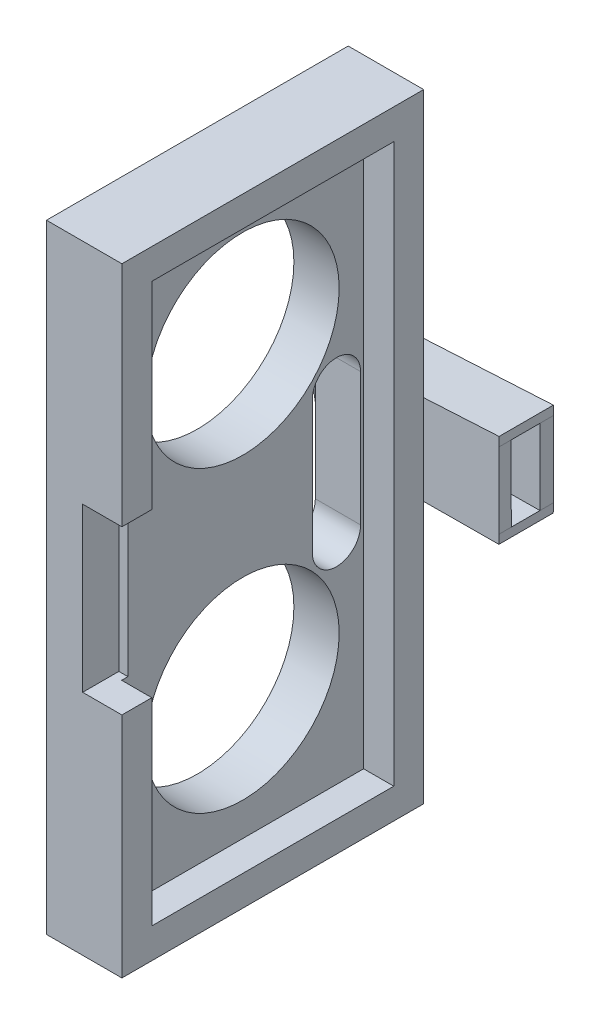
ISO-10303-21;
HEADER;
FILE_DESCRIPTION(('STEP AP214'),'2;1');
FILE_NAME('part.step','',(''),(''),'','','');
FILE_SCHEMA(('AUTOMOTIVE_DESIGN { 1 0 10303 214 1 1 1 1 }'));
ENDSEC;
DATA;
#1=APPLICATION_CONTEXT('core data for automotive mechanical design processes');
#2=APPLICATION_PROTOCOL_DEFINITION('international standard','automotive_design',2000,#1);
#3=PRODUCT_CONTEXT('',#1,'mechanical');
#4=PRODUCT('Part','Part','',(#3));
#5=PRODUCT_RELATED_PRODUCT_CATEGORY('part','',(#4));
#6=PRODUCT_DEFINITION_FORMATION('','',#4);
#7=PRODUCT_DEFINITION_CONTEXT('part definition',#1,'design');
#8=PRODUCT_DEFINITION('design','',#6,#7);
#9=PRODUCT_DEFINITION_SHAPE('','',#8);
#10=(LENGTH_UNIT() NAMED_UNIT(*) SI_UNIT(.MILLI.,.METRE.));
#11=(NAMED_UNIT(*) PLANE_ANGLE_UNIT() SI_UNIT($,.RADIAN.));
#12=(NAMED_UNIT(*) SI_UNIT($,.STERADIAN.) SOLID_ANGLE_UNIT());
#13=UNCERTAINTY_MEASURE_WITH_UNIT(LENGTH_MEASURE(1.E-05),#10,'distance_accuracy_value','');
#14=(GEOMETRIC_REPRESENTATION_CONTEXT(3) GLOBAL_UNCERTAINTY_ASSIGNED_CONTEXT((#13)) GLOBAL_UNIT_ASSIGNED_CONTEXT((#10,
#11,#12)) REPRESENTATION_CONTEXT('',''));
#15=CARTESIAN_POINT('',(0.,0.,0.));
#16=DIRECTION('',(0.,0.,1.));
#17=DIRECTION('',(1.,0.,0.));
#18=AXIS2_PLACEMENT_3D('',#15,#16,#17);
#19=CARTESIAN_POINT('',(-11.1100924159061,-23.495,24.4094));
#20=DIRECTION('',(0.,0.,1.));
#21=DIRECTION('',(1.,0.,0.));
#22=AXIS2_PLACEMENT_3D('',#19,#20,#21);
#23=PLANE('',#22);
#24=DIRECTION('',(0.,-1.,0.));
#25=VECTOR('',#24,1.);
#26=CARTESIAN_POINT('',(-8.57009241590608,-23.495,24.4094));
#27=LINE('',#26,#25);
#28=CARTESIAN_POINT('',(-8.57009241590608,23.495,24.4094));
#29=VERTEX_POINT('',#28);
#30=CARTESIAN_POINT('',(-8.57009241590608,6.858,24.4094));
#31=VERTEX_POINT('',#30);
#32=EDGE_CURVE('E331',#29,#31,#27,.T.);
#33=ORIENTED_EDGE('',*,*,#32,.T.);
#34=DIRECTION('',(-1.,0.,0.));
#35=VECTOR('',#34,1.);
#36=CARTESIAN_POINT('',(-11.1100924159061,6.858,24.4094));
#37=LINE('',#36,#35);
#38=CARTESIAN_POINT('',(-11.1100924159061,6.858,24.4094));
#39=VERTEX_POINT('',#38);
#40=EDGE_CURVE('E301',#31,#39,#37,.T.);
#41=ORIENTED_EDGE('',*,*,#40,.T.);
#42=DIRECTION('',(0.,-1.,0.));
#43=VECTOR('',#42,1.);
#44=CARTESIAN_POINT('',(-11.1100924159061,-23.495,24.4094));
#45=LINE('',#44,#43);
#46=CARTESIAN_POINT('',(-11.1100924159061,23.495,24.4094));
#47=VERTEX_POINT('',#46);
#48=EDGE_CURVE('E317',#47,#39,#45,.T.);
#49=ORIENTED_EDGE('',*,*,#48,.F.);
#50=DIRECTION('',(1.,0.,0.));
#51=VECTOR('',#50,1.);
#52=CARTESIAN_POINT('',(-11.1100924159061,23.495,24.4094));
#53=LINE('',#52,#51);
#54=EDGE_CURVE('E343',#47,#29,#53,.T.);
#55=ORIENTED_EDGE('',*,*,#54,.T.);
#56=EDGE_LOOP('',(#33,#41,#49,#55));
#57=FACE_BOUND('',#56,.T.);
#58=ADVANCED_FACE('F41',(#57),#23,.F.);
#59=CARTESIAN_POINT('',(0.,0.,1.524));
#60=DIRECTION('',(0.,0.,1.));
#61=DIRECTION('',(1.,0.,0.));
#62=AXIS2_PLACEMENT_3D('',#59,#60,#61);
#63=PLANE('',#62);
#64=DIRECTION('',(0.,-1.,0.));
#65=VECTOR('',#64,1.);
#66=CARTESIAN_POINT('',(-14.9200924159061,26.035,1.524));
#67=LINE('',#66,#65);
#68=CARTESIAN_POINT('',(-14.9200924159061,3.18748476865478,1.524));
#69=VERTEX_POINT('',#68);
#70=CARTESIAN_POINT('',(-14.9200924159061,-3.94417336261971,1.524));
#71=VERTEX_POINT('',#70);
#72=EDGE_CURVE('E369',#69,#71,#67,.T.);
#73=ORIENTED_EDGE('',*,*,#72,.F.);
#74=CARTESIAN_POINT('',(-14.1591219670421,-0.378344296982466,1.524));
#75=DIRECTION('',(0.,0.,1.));
#76=DIRECTION('',(1.,0.,0.));
#77=AXIS2_PLACEMENT_3D('',#74,#75,#76);
#78=CIRCLE('',#77,3.64612300250384);
#79=EDGE_CURVE('E428',#69,#71,#78,.T.);
#80=ORIENTED_EDGE('',*,*,#79,.T.);
#81=EDGE_LOOP('',(#73,#80));
#82=FACE_BOUND('',#81,.T.);
#83=ADVANCED_FACE('F532',(#82),#63,.T.);
#84=CARTESIAN_POINT('',(-0.178664404636006,3.26970413285016,-3.048));
#85=DIRECTION('',(0.0545609835210733,-0.998510440144325,0.));
#86=DIRECTION('',(0.998510440144325,0.0545609835210733,0.));
#87=AXIS2_PLACEMENT_3D('',#84,#85,#86);
#88=PLANE('',#87);
#89=DIRECTION('',(0.,0.,1.));
#90=VECTOR('',#89,1.);
#91=CARTESIAN_POINT('',(-14.1591219670421,2.50577870552137,-3.048));
#92=LINE('',#91,#90);
#93=CARTESIAN_POINT('',(-14.1591219670421,2.50577870552137,-1.905));
#94=VERTEX_POINT('',#93);
#95=CARTESIAN_POINT('',(-14.1591219670421,2.50577870552137,0.508));
#96=VERTEX_POINT('',#95);
#97=EDGE_CURVE('E458',#94,#96,#92,.T.);
#98=ORIENTED_EDGE('',*,*,#97,.F.);
#99=DIRECTION('',(0.998510440144325,0.0545609835210732,0.));
#100=VECTOR('',#99,1.);
#101=CARTESIAN_POINT('',(-14.1591219670421,2.50577870552137,-1.905));
#102=LINE('',#101,#100);
#103=CARTESIAN_POINT('',(-2.22112196704214,3.15809939751176,-1.905));
#104=VERTEX_POINT('',#103);
#105=EDGE_CURVE('E391',#94,#104,#102,.T.);
#106=ORIENTED_EDGE('',*,*,#105,.T.);
#107=DIRECTION('',(0.,0.,1.));
#108=VECTOR('',#107,1.);
#109=CARTESIAN_POINT('',(-2.22112196704214,3.15809939751176,-3.048));
#110=LINE('',#109,#108);
#111=CARTESIAN_POINT('',(-2.22112196704214,3.15809939751176,0.508));
#112=VERTEX_POINT('',#111);
#113=EDGE_CURVE('E457',#104,#112,#110,.T.);
#114=ORIENTED_EDGE('',*,*,#113,.T.);
#115=DIRECTION('',(-0.998510440144325,-0.0545609835210736,0.));
#116=VECTOR('',#115,1.);
#117=CARTESIAN_POINT('',(-14.1591219670421,2.50577870552137,0.508));
#118=LINE('',#117,#116);
#119=EDGE_CURVE('E407',#112,#96,#118,.T.);
#120=ORIENTED_EDGE('',*,*,#119,.T.);
#121=EDGE_LOOP('',(#98,#106,#114,#120));
#122=FACE_BOUND('',#121,.T.);
#123=ADVANCED_FACE('F537',(#122),#88,.T.);
#124=CARTESIAN_POINT('',(-14.1591219670421,-0.378344296982466,-3.048));
#125=DIRECTION('',(0.,0.,1.));
#126=DIRECTION('',(1.,0.,0.));
#127=AXIS2_PLACEMENT_3D('',#124,#125,#126);
#128=CYLINDRICAL_SURFACE('',#127,2.88412300250383);
#129=CARTESIAN_POINT('',(-14.1591219670421,-0.378344296982466,-1.905));
#130=DIRECTION('',(0.,0.,-1.));
#131=DIRECTION('',(-1.,0.,0.));
#132=AXIS2_PLACEMENT_3D('',#129,#130,#131);
#133=CIRCLE('',#132,2.88412300250383);
#134=CARTESIAN_POINT('',(-14.1470722034374,-3.26244212763398,-1.905));
#135=VERTEX_POINT('',#134);
#136=EDGE_CURVE('E389',#135,#94,#133,.T.);
#137=ORIENTED_EDGE('',*,*,#136,.T.);
#138=ORIENTED_EDGE('',*,*,#97,.T.);
#139=CARTESIAN_POINT('',(-14.1591219670421,-0.378344296982466,0.508));
#140=DIRECTION('',(0.,0.,1.));
#141=DIRECTION('',(1.,0.,0.));
#142=AXIS2_PLACEMENT_3D('',#139,#140,#141);
#143=CIRCLE('',#142,2.88412300250383);
#144=CARTESIAN_POINT('',(-14.1470722034374,-3.26244212763398,0.508));
#145=VERTEX_POINT('',#144);
#146=EDGE_CURVE('E410',#96,#145,#143,.T.);
#147=ORIENTED_EDGE('',*,*,#146,.T.);
#148=DIRECTION('',(0.,0.,1.));
#149=VECTOR('',#148,1.);
#150=CARTESIAN_POINT('',(-14.1470722034374,-3.26244212763398,-3.048));
#151=LINE('',#150,#149);
#152=EDGE_CURVE('E460',#135,#145,#151,.T.);
#153=ORIENTED_EDGE('',*,*,#152,.F.);
#154=EDGE_LOOP('',(#137,#138,#147,#153));
#155=FACE_BOUND('',#154,.T.);
#156=ADVANCED_FACE('F596',(#155),#128,.F.);
#157=CARTESIAN_POINT('',(0.0187831212515852,-3.17873622718185,-3.048));
#158=DIRECTION('',(0.00590888705463329,-0.999982542374504,0.));
#159=DIRECTION('',(0.999982542374504,0.00590888705463329,0.));
#160=AXIS2_PLACEMENT_3D('',#157,#158,#159);
#161=PLANE('',#160);
#162=DIRECTION('',(-0.999982542374503,-0.00590888705463329,0.));
#163=VECTOR('',#162,1.);
#164=CARTESIAN_POINT('',(-14.1470722034374,-3.26244212763398,-1.905));
#165=LINE('',#164,#163);
#166=CARTESIAN_POINT('',(-2.20907220343745,-3.19190060248824,-1.905));
#167=VERTEX_POINT('',#166);
#168=EDGE_CURVE('E396',#167,#135,#165,.T.);
#169=ORIENTED_EDGE('',*,*,#168,.T.);
#170=ORIENTED_EDGE('',*,*,#152,.T.);
#171=DIRECTION('',(0.999982542374503,0.00590888705463329,0.));
#172=VECTOR('',#171,1.);
#173=CARTESIAN_POINT('',(-2.20907220343745,-3.19190060248824,0.508));
#174=LINE('',#173,#172);
#175=CARTESIAN_POINT('',(-2.20907220343745,-3.19190060248824,0.508));
#176=VERTEX_POINT('',#175);
#177=EDGE_CURVE('E401',#145,#176,#174,.T.);
#178=ORIENTED_EDGE('',*,*,#177,.T.);
#179=DIRECTION('',(0.,0.,1.));
#180=VECTOR('',#179,1.);
#181=CARTESIAN_POINT('',(-2.20907220343745,-3.19190060248824,-3.048));
#182=LINE('',#181,#180);
#183=EDGE_CURVE('E465',#167,#176,#182,.T.);
#184=ORIENTED_EDGE('',*,*,#183,.F.);
#185=EDGE_LOOP('',(#169,#170,#178,#184));
#186=FACE_BOUND('',#185,.T.);
#187=ADVANCED_FACE('F600',(#186),#161,.F.);
#188=CARTESIAN_POINT('',(-0.220177944928801,4.02943573434699,-3.048));
#189=DIRECTION('',(-0.0545609835210734,0.998510440144325,0.));
#190=DIRECTION('',(-0.998510440144325,-0.0545609835210734,0.));
#191=AXIS2_PLACEMENT_3D('',#188,#189,#190);
#192=PLANE('',#191);
#193=DIRECTION('',(0.,0.,1.));
#194=VECTOR('',#193,1.);
#195=CARTESIAN_POINT('',(-14.1591219670421,3.26777870552137,-3.048));
#196=LINE('',#195,#194);
#197=CARTESIAN_POINT('',(-14.1591219670421,3.26777870552137,-3.048));
#198=VERTEX_POINT('',#197);
#199=CARTESIAN_POINT('',(-14.1591219670421,3.26777870552137,1.524));
#200=VERTEX_POINT('',#199);
#201=EDGE_CURVE('E451',#198,#200,#196,.T.);
#202=ORIENTED_EDGE('',*,*,#201,.T.);
#203=DIRECTION('',(-0.998510440144325,-0.0545609835210734,0.));
#204=VECTOR('',#203,1.);
#205=CARTESIAN_POINT('',(-0.220177944928801,4.02943573434699,1.524));
#206=LINE('',#205,#204);
#207=CARTESIAN_POINT('',(-8.57009241590608,3.57317656314843,1.524));
#208=VERTEX_POINT('',#207);
#209=EDGE_CURVE('E418',#208,#200,#206,.T.);
#210=ORIENTED_EDGE('',*,*,#209,.F.);
#211=CARTESIAN_POINT('',(-2.22112196704214,3.92009939751176,1.524));
#212=VERTEX_POINT('',#211);
#213=EDGE_CURVE('E421',#212,#208,#206,.T.);
#214=ORIENTED_EDGE('',*,*,#213,.F.);
#215=DIRECTION('',(0.,0.,1.));
#216=VECTOR('',#215,1.);
#217=CARTESIAN_POINT('',(-2.22112196704214,3.92009939751176,-3.048));
#218=LINE('',#217,#216);
#219=CARTESIAN_POINT('',(-2.22112196704214,3.92009939751176,-3.048));
#220=VERTEX_POINT('',#219);
#221=EDGE_CURVE('E452',#220,#212,#218,.T.);
#222=ORIENTED_EDGE('',*,*,#221,.F.);
#223=DIRECTION('',(-0.998510440144325,-0.0545609835210734,0.));
#224=VECTOR('',#223,1.);
#225=CARTESIAN_POINT('',(-0.220177944928801,4.02943573434699,-3.048));
#226=LINE('',#225,#224);
#227=EDGE_CURVE('E438',#220,#198,#226,.T.);
#228=ORIENTED_EDGE('',*,*,#227,.T.);
#229=EDGE_LOOP('',(#202,#210,#214,#222,#228));
#230=FACE_BOUND('',#229,.T.);
#231=ADVANCED_FACE('F43',(#230),#192,.T.);
#232=CARTESIAN_POINT('',(-2.22112196704214,0.,-3.048));
#233=DIRECTION('',(1.,0.,0.));
#234=DIRECTION('',(0.,0.,-1.));
#235=AXIS2_PLACEMENT_3D('',#232,#233,#234);
#236=PLANE('',#235);
#237=ORIENTED_EDGE('',*,*,#221,.T.);
#238=DIRECTION('',(0.,1.,0.));
#239=VECTOR('',#238,1.);
#240=CARTESIAN_POINT('',(-2.22112196704214,0.,1.524));
#241=LINE('',#240,#239);
#242=CARTESIAN_POINT('',(-2.22112196704214,3.15809939751176,1.524));
#243=VERTEX_POINT('',#242);
#244=EDGE_CURVE('E435',#243,#212,#241,.T.);
#245=ORIENTED_EDGE('',*,*,#244,.F.);
#246=DIRECTION('',(0.,0.,1.));
#247=VECTOR('',#246,1.);
#248=CARTESIAN_POINT('',(-2.22112196704214,3.15809939751176,0.508));
#249=LINE('',#248,#247);
#250=EDGE_CURVE('E415',#112,#243,#249,.T.);
#251=ORIENTED_EDGE('',*,*,#250,.F.);
#252=ORIENTED_EDGE('',*,*,#113,.F.);
#253=CARTESIAN_POINT('',(-2.22112196704214,3.15809939751176,-3.048));
#254=VERTEX_POINT('',#253);
#255=EDGE_CURVE('E454',#254,#104,#110,.T.);
#256=ORIENTED_EDGE('',*,*,#255,.F.);
#257=DIRECTION('',(0.,1.,0.));
#258=VECTOR('',#257,1.);
#259=CARTESIAN_POINT('',(-2.22112196704214,0.,-3.048));
#260=LINE('',#259,#258);
#261=EDGE_CURVE('E448',#254,#220,#260,.T.);
#262=ORIENTED_EDGE('',*,*,#261,.T.);
#263=EDGE_LOOP('',(#237,#245,#251,#252,#256,#262));
#264=FACE_BOUND('',#263,.T.);
#265=ADVANCED_FACE('F589',(#264),#236,.T.);
#266=CARTESIAN_POINT('',(-2.09947621810218,0.0705284801545725,-3.048));
#267=DIRECTION('',(0.999436219896617,-0.0335744301330823,0.));
#268=DIRECTION('',(0.0335744301330823,0.999436219896617,0.));
#269=AXIS2_PLACEMENT_3D('',#266,#267,#268);
#270=PLANE('',#269);
#271=CARTESIAN_POINT('',(-2.20907220343745,-3.19190060248824,-3.048));
#272=VERTEX_POINT('',#271);
#273=EDGE_CURVE('E462',#272,#167,#182,.T.);
#274=ORIENTED_EDGE('',*,*,#273,.T.);
#275=ORIENTED_EDGE('',*,*,#183,.T.);
#276=DIRECTION('',(0.,0.,1.));
#277=VECTOR('',#276,1.);
#278=CARTESIAN_POINT('',(-2.20907220343745,-3.19190060248824,0.508));
#279=LINE('',#278,#277);
#280=CARTESIAN_POINT('',(-2.20907220343745,-3.19190060248824,1.524));
#281=VERTEX_POINT('',#280);
#282=EDGE_CURVE('E413',#176,#281,#279,.T.);
#283=ORIENTED_EDGE('',*,*,#282,.T.);
#284=DIRECTION('',(0.0335744301330823,0.999436219896617,0.));
#285=VECTOR('',#284,1.);
#286=CARTESIAN_POINT('',(-2.09947621810218,0.0705284801545725,1.524));
#287=LINE('',#286,#285);
#288=CARTESIAN_POINT('',(-2.2346703509251,-3.95390060248824,1.524));
#289=VERTEX_POINT('',#288);
#290=EDGE_CURVE('E432',#289,#281,#287,.T.);
#291=ORIENTED_EDGE('',*,*,#290,.F.);
#292=DIRECTION('',(0.,0.,1.));
#293=VECTOR('',#292,1.);
#294=CARTESIAN_POINT('',(-2.2346703509251,-3.95390060248824,-3.048));
#295=LINE('',#294,#293);
#296=CARTESIAN_POINT('',(-2.2346703509251,-3.95390060248824,-3.048));
#297=VERTEX_POINT('',#296);
#298=EDGE_CURVE('E466',#297,#289,#295,.T.);
#299=ORIENTED_EDGE('',*,*,#298,.F.);
#300=DIRECTION('',(0.0335744301330823,0.999436219896617,0.));
#301=VECTOR('',#300,1.);
#302=CARTESIAN_POINT('',(-2.09947621810218,0.0705284801545725,-3.048));
#303=LINE('',#302,#301);
#304=EDGE_CURVE('E446',#297,#272,#303,.T.);
#305=ORIENTED_EDGE('',*,*,#304,.T.);
#306=EDGE_LOOP('',(#274,#275,#283,#291,#299,#305));
#307=FACE_BOUND('',#306,.T.);
#308=ADVANCED_FACE('F592',(#307),#270,.T.);
#309=CARTESIAN_POINT('',(0.0232847208250612,-3.9405583680711,-3.048));
#310=DIRECTION('',(-0.00590888705463406,0.999982542374504,0.));
#311=DIRECTION('',(-0.999982542374504,-0.00590888705463406,0.));
#312=AXIS2_PLACEMENT_3D('',#309,#310,#311);
#313=PLANE('',#312);
#314=ORIENTED_EDGE('',*,*,#298,.T.);
#315=DIRECTION('',(-0.999982542374504,-0.00590888705463406,0.));
#316=VECTOR('',#315,1.);
#317=CARTESIAN_POINT('',(0.0232847208250612,-3.9405583680711,1.524));
#318=LINE('',#317,#316);
#319=CARTESIAN_POINT('',(-8.57009241590608,-3.99133654945639,1.524));
#320=VERTEX_POINT('',#319);
#321=EDGE_CURVE('E429',#289,#320,#318,.T.);
#322=ORIENTED_EDGE('',*,*,#321,.T.);
#323=CARTESIAN_POINT('',(-14.1726703509251,-4.02444212763399,1.524));
#324=VERTEX_POINT('',#323);
#325=EDGE_CURVE('E427',#320,#324,#318,.T.);
#326=ORIENTED_EDGE('',*,*,#325,.T.);
#327=DIRECTION('',(0.,0.,1.));
#328=VECTOR('',#327,1.);
#329=CARTESIAN_POINT('',(-14.1726703509251,-4.02444212763399,-3.048));
#330=LINE('',#329,#328);
#331=CARTESIAN_POINT('',(-14.1726703509251,-4.02444212763399,-3.048));
#332=VERTEX_POINT('',#331);
#333=EDGE_CURVE('E468',#332,#324,#330,.T.);
#334=ORIENTED_EDGE('',*,*,#333,.F.);
#335=DIRECTION('',(-0.999982542374504,-0.00590888705463406,0.));
#336=VECTOR('',#335,1.);
#337=CARTESIAN_POINT('',(0.0232847208250612,-3.9405583680711,-3.048));
#338=LINE('',#337,#336);
#339=EDGE_CURVE('E444',#297,#332,#338,.T.);
#340=ORIENTED_EDGE('',*,*,#339,.F.);
#341=EDGE_LOOP('',(#314,#322,#326,#334,#340));
#342=FACE_BOUND('',#341,.T.);
#343=ADVANCED_FACE('F607',(#342),#313,.F.);
#344=CARTESIAN_POINT('',(-14.1591219670421,-0.378344296982466,-3.048));
#345=DIRECTION('',(0.,0.,1.));
#346=DIRECTION('',(1.,0.,0.));
#347=AXIS2_PLACEMENT_3D('',#344,#345,#346);
#348=CYLINDRICAL_SURFACE('',#347,3.64612300250384);
#349=ORIENTED_EDGE('',*,*,#333,.T.);
#350=EDGE_CURVE('E423',#71,#324,#78,.T.);
#351=ORIENTED_EDGE('',*,*,#350,.F.);
#352=ORIENTED_EDGE('',*,*,#79,.F.);
#353=EDGE_CURVE('E424',#200,#69,#78,.T.);
#354=ORIENTED_EDGE('',*,*,#353,.F.);
#355=ORIENTED_EDGE('',*,*,#201,.F.);
#356=CARTESIAN_POINT('',(-14.1591219670421,-0.378344296982466,-3.048));
#357=DIRECTION('',(0.,0.,1.));
#358=DIRECTION('',(1.,0.,0.));
#359=AXIS2_PLACEMENT_3D('',#356,#357,#358);
#360=CIRCLE('',#359,3.64612300250384);
#361=EDGE_CURVE('E441',#198,#332,#360,.T.);
#362=ORIENTED_EDGE('',*,*,#361,.T.);
#363=EDGE_LOOP('',(#349,#351,#352,#354,#355,#362));
#364=FACE_BOUND('',#363,.T.);
#365=ADVANCED_FACE('F587',(#364),#348,.T.);
#366=CARTESIAN_POINT('',(0.,0.,-3.048));
#367=DIRECTION('',(0.,0.,1.));
#368=DIRECTION('',(1.,0.,0.));
#369=AXIS2_PLACEMENT_3D('',#366,#367,#368);
#370=PLANE('',#369);
#371=DIRECTION('',(0.0018975971511536,-0.999998199560905,0.));
#372=VECTOR('',#371,1.);
#373=CARTESIAN_POINT('',(-2.20907220343745,-3.19190060248824,-3.048));
#374=LINE('',#373,#372);
#375=EDGE_CURVE('E388',#254,#272,#374,.T.);
#376=ORIENTED_EDGE('',*,*,#375,.T.);
#377=ORIENTED_EDGE('',*,*,#304,.F.);
#378=ORIENTED_EDGE('',*,*,#339,.T.);
#379=ORIENTED_EDGE('',*,*,#361,.F.);
#380=ORIENTED_EDGE('',*,*,#227,.F.);
#381=ORIENTED_EDGE('',*,*,#261,.F.);
#382=EDGE_LOOP('',(#376,#377,#378,#379,#380,#381));
#383=FACE_BOUND('',#382,.T.);
#384=ADVANCED_FACE('F583',(#383),#370,.F.);
#385=DIRECTION('',(0.,1.,0.));
#386=VECTOR('',#385,1.);
#387=CARTESIAN_POINT('',(-8.57009241590608,26.035,1.524));
#388=LINE('',#387,#386);
#389=EDGE_CURVE('E375',#320,#208,#388,.T.);
#390=ORIENTED_EDGE('',*,*,#389,.F.);
#391=ORIENTED_EDGE('',*,*,#321,.F.);
#392=ORIENTED_EDGE('',*,*,#290,.T.);
#393=DIRECTION('',(-0.0018975971511536,0.999998199560905,0.));
#394=VECTOR('',#393,1.);
#395=CARTESIAN_POINT('',(-2.20907220343745,-3.19190060248824,1.524));
#396=LINE('',#395,#394);
#397=EDGE_CURVE('E398',#281,#243,#396,.T.);
#398=ORIENTED_EDGE('',*,*,#397,.T.);
#399=ORIENTED_EDGE('',*,*,#244,.T.);
#400=ORIENTED_EDGE('',*,*,#213,.T.);
#401=EDGE_LOOP('',(#390,#391,#392,#398,#399,#400));
#402=FACE_BOUND('',#401,.T.);
#403=ADVANCED_FACE('F540',(#402),#63,.T.);
#404=CARTESIAN_POINT('',(-2.20907220343745,-3.19190060248824,0.508));
#405=DIRECTION('',(0.999998199560905,0.0018975971511536,0.));
#406=DIRECTION('',(-0.0018975971511536,0.999998199560905,0.));
#407=AXIS2_PLACEMENT_3D('',#404,#405,#406);
#408=PLANE('',#407);
#409=ORIENTED_EDGE('',*,*,#397,.F.);
#410=ORIENTED_EDGE('',*,*,#282,.F.);
#411=DIRECTION('',(-0.0018975971511536,0.999998199560905,0.));
#412=VECTOR('',#411,1.);
#413=CARTESIAN_POINT('',(-2.20907220343745,-3.19190060248824,0.508));
#414=LINE('',#413,#412);
#415=EDGE_CURVE('E404',#176,#112,#414,.T.);
#416=ORIENTED_EDGE('',*,*,#415,.T.);
#417=ORIENTED_EDGE('',*,*,#250,.T.);
#418=EDGE_LOOP('',(#409,#410,#416,#417));
#419=FACE_BOUND('',#418,.T.);
#420=ADVANCED_FACE('F577',(#419),#408,.T.);
#421=CARTESIAN_POINT('',(-14.1591219670421,-0.378344296982466,0.508));
#422=DIRECTION('',(0.,0.,1.));
#423=DIRECTION('',(1.,0.,0.));
#424=AXIS2_PLACEMENT_3D('',#421,#422,#423);
#425=PLANE('',#424);
#426=ORIENTED_EDGE('',*,*,#177,.F.);
#427=ORIENTED_EDGE('',*,*,#146,.F.);
#428=ORIENTED_EDGE('',*,*,#119,.F.);
#429=ORIENTED_EDGE('',*,*,#415,.F.);
#430=EDGE_LOOP('',(#426,#427,#428,#429));
#431=FACE_BOUND('',#430,.T.);
#432=ADVANCED_FACE('F573',(#431),#425,.F.);
#433=CARTESIAN_POINT('',(-2.20907220343745,-3.19190060248824,-1.905));
#434=DIRECTION('',(0.999998199560905,0.0018975971511536,0.));
#435=DIRECTION('',(-0.0018975971511536,0.999998199560905,0.));
#436=AXIS2_PLACEMENT_3D('',#433,#434,#435);
#437=PLANE('',#436);
#438=ORIENTED_EDGE('',*,*,#375,.F.);
#439=ORIENTED_EDGE('',*,*,#255,.T.);
#440=DIRECTION('',(0.0018975971511536,-0.999998199560905,0.));
#441=VECTOR('',#440,1.);
#442=CARTESIAN_POINT('',(-2.20907220343745,-3.19190060248824,-1.905));
#443=LINE('',#442,#441);
#444=EDGE_CURVE('E393',#104,#167,#443,.T.);
#445=ORIENTED_EDGE('',*,*,#444,.T.);
#446=ORIENTED_EDGE('',*,*,#273,.F.);
#447=EDGE_LOOP('',(#438,#439,#445,#446));
#448=FACE_BOUND('',#447,.T.);
#449=ADVANCED_FACE('F569',(#448),#437,.T.);
#450=CARTESIAN_POINT('',(-14.1591219670421,-0.378344296982466,-1.905));
#451=DIRECTION('',(0.,0.,-1.));
#452=DIRECTION('',(-1.,0.,0.));
#453=AXIS2_PLACEMENT_3D('',#450,#451,#452);
#454=PLANE('',#453);
#455=ORIENTED_EDGE('',*,*,#136,.F.);
#456=ORIENTED_EDGE('',*,*,#168,.F.);
#457=ORIENTED_EDGE('',*,*,#444,.F.);
#458=ORIENTED_EDGE('',*,*,#105,.F.);
#459=EDGE_LOOP('',(#455,#456,#457,#458));
#460=FACE_BOUND('',#459,.T.);
#461=ADVANCED_FACE('F556',(#460),#454,.F.);
#462=CARTESIAN_POINT('',(0.,0.,1.524));
#463=DIRECTION('',(0.,0.,1.));
#464=DIRECTION('',(1.,0.,0.));
#465=AXIS2_PLACEMENT_3D('',#462,#463,#464);
#466=PLANE('',#465);
#467=CARTESIAN_POINT('',(-8.57009241590608,26.035,1.524));
#468=VERTEX_POINT('',#467);
#469=EDGE_CURVE('E371',#208,#468,#388,.T.);
#470=ORIENTED_EDGE('',*,*,#469,.F.);
#471=ORIENTED_EDGE('',*,*,#209,.T.);
#472=ORIENTED_EDGE('',*,*,#353,.T.);
#473=CARTESIAN_POINT('',(-14.9200924159061,26.035,1.524));
#474=VERTEX_POINT('',#473);
#475=EDGE_CURVE('E365',#474,#69,#67,.T.);
#476=ORIENTED_EDGE('',*,*,#475,.F.);
#477=DIRECTION('',(-1.,0.,0.));
#478=VECTOR('',#477,1.);
#479=CARTESIAN_POINT('',(-14.9200924159061,26.035,1.524));
#480=LINE('',#479,#478);
#481=EDGE_CURVE('E356',#468,#474,#480,.T.);
#482=ORIENTED_EDGE('',*,*,#481,.F.);
#483=EDGE_LOOP('',(#470,#471,#472,#476,#482));
#484=FACE_BOUND('',#483,.T.);
#485=ADVANCED_FACE('F553',(#484),#466,.F.);
#486=CARTESIAN_POINT('',(-14.9200924159061,-26.035,1.524));
#487=VERTEX_POINT('',#486);
#488=EDGE_CURVE('E345',#71,#487,#67,.T.);
#489=ORIENTED_EDGE('',*,*,#488,.F.);
#490=ORIENTED_EDGE('',*,*,#350,.T.);
#491=ORIENTED_EDGE('',*,*,#325,.F.);
#492=CARTESIAN_POINT('',(-8.57009241590608,-26.035,1.524));
#493=VERTEX_POINT('',#492);
#494=EDGE_CURVE('E372',#493,#320,#388,.T.);
#495=ORIENTED_EDGE('',*,*,#494,.F.);
#496=DIRECTION('',(1.,0.,0.));
#497=VECTOR('',#496,1.);
#498=CARTESIAN_POINT('',(-14.9200924159061,-26.035,1.524));
#499=LINE('',#498,#497);
#500=EDGE_CURVE('E368',#487,#493,#499,.T.);
#501=ORIENTED_EDGE('',*,*,#500,.F.);
#502=EDGE_LOOP('',(#489,#490,#491,#495,#501));
#503=FACE_BOUND('',#502,.T.);
#504=ADVANCED_FACE('F555',(#503),#466,.F.);
#505=CARTESIAN_POINT('',(-14.9200924159061,26.035,26.924));
#506=DIRECTION('',(1.,0.,0.));
#507=DIRECTION('',(0.,0.,-1.));
#508=AXIS2_PLACEMENT_3D('',#505,#506,#507);
#509=PLANE('',#508);
#510=DIRECTION('',(0.,-1.,0.));
#511=VECTOR('',#510,1.);
#512=CARTESIAN_POINT('',(-14.9200924159061,-5.588,8.3566));
#513=LINE('',#512,#511);
#514=CARTESIAN_POINT('',(-14.9200924159061,5.588,8.3566));
#515=VERTEX_POINT('',#514);
#516=CARTESIAN_POINT('',(-14.9200924159061,-5.588,8.3566));
#517=VERTEX_POINT('',#516);
#518=EDGE_CURVE('E246',#515,#517,#513,.T.);
#519=ORIENTED_EDGE('',*,*,#518,.T.);
#520=CARTESIAN_POINT('',(-14.9200924159061,-5.588,6.3246));
#521=DIRECTION('',(1.,0.,0.));
#522=DIRECTION('',(0.,0.,-1.));
#523=AXIS2_PLACEMENT_3D('',#520,#521,#522);
#524=CIRCLE('',#523,2.032);
#525=CARTESIAN_POINT('',(-14.9200924159061,-5.588,4.2926));
#526=VERTEX_POINT('',#525);
#527=EDGE_CURVE('E240',#517,#526,#524,.T.);
#528=ORIENTED_EDGE('',*,*,#527,.T.);
#529=DIRECTION('',(0.,1.,0.));
#530=VECTOR('',#529,1.);
#531=CARTESIAN_POINT('',(-14.9200924159061,-5.588,4.2926));
#532=LINE('',#531,#530);
#533=CARTESIAN_POINT('',(-14.9200924159061,5.588,4.2926));
#534=VERTEX_POINT('',#533);
#535=EDGE_CURVE('E249',#526,#534,#532,.T.);
#536=ORIENTED_EDGE('',*,*,#535,.T.);
#537=CARTESIAN_POINT('',(-14.9200924159061,5.588,6.3246));
#538=DIRECTION('',(1.,0.,0.));
#539=DIRECTION('',(0.,0.,-1.));
#540=AXIS2_PLACEMENT_3D('',#537,#538,#539);
#541=CIRCLE('',#540,2.032);
#542=EDGE_CURVE('E56',#534,#515,#541,.T.);
#543=ORIENTED_EDGE('',*,*,#542,.T.);
#544=EDGE_LOOP('',(#519,#528,#536,#543));
#545=FACE_BOUND('',#544,.T.);
#546=CARTESIAN_POINT('',(-14.9200924159061,-12.573,14.224));
#547=DIRECTION('',(1.,0.,0.));
#548=DIRECTION('',(0.,0.,-1.));
#549=AXIS2_PLACEMENT_3D('',#546,#547,#548);
#550=CIRCLE('',#549,8.128);
#551=CARTESIAN_POINT('',(-14.9200924159061,-12.573,6.096));
#552=VERTEX_POINT('',#551);
#553=EDGE_CURVE('E313',#552,#552,#550,.T.);
#554=ORIENTED_EDGE('',*,*,#553,.T.);
#555=EDGE_LOOP('',(#554));
#556=FACE_BOUND('',#555,.T.);
#557=CARTESIAN_POINT('',(-14.9200924159061,12.573,14.224));
#558=DIRECTION('',(1.,0.,0.));
#559=DIRECTION('',(0.,0.,-1.));
#560=AXIS2_PLACEMENT_3D('',#557,#558,#559);
#561=CIRCLE('',#560,8.128);
#562=CARTESIAN_POINT('',(-14.9200924159061,12.573,6.096));
#563=VERTEX_POINT('',#562);
#564=EDGE_CURVE('E308',#563,#563,#561,.T.);
#565=ORIENTED_EDGE('',*,*,#564,.T.);
#566=EDGE_LOOP('',(#565));
#567=FACE_BOUND('',#566,.T.);
#568=ORIENTED_EDGE('',*,*,#475,.T.);
#569=ORIENTED_EDGE('',*,*,#72,.T.);
#570=ORIENTED_EDGE('',*,*,#488,.T.);
#571=DIRECTION('',(0.,0.,-1.));
#572=VECTOR('',#571,1.);
#573=CARTESIAN_POINT('',(-14.9200924159061,-26.035,26.924));
#574=LINE('',#573,#572);
#575=CARTESIAN_POINT('',(-14.9200924159061,-26.035,26.924));
#576=VERTEX_POINT('',#575);
#577=EDGE_CURVE('E385',#576,#487,#574,.T.);
#578=ORIENTED_EDGE('',*,*,#577,.F.);
#579=DIRECTION('',(0.,-1.,0.));
#580=VECTOR('',#579,1.);
#581=CARTESIAN_POINT('',(-14.9200924159061,26.035,26.924));
#582=LINE('',#581,#580);
#583=CARTESIAN_POINT('',(-14.9200924159061,26.035,26.924));
#584=VERTEX_POINT('',#583);
#585=EDGE_CURVE('E352',#584,#576,#582,.T.);
#586=ORIENTED_EDGE('',*,*,#585,.F.);
#587=DIRECTION('',(0.,0.,-1.));
#588=VECTOR('',#587,1.);
#589=CARTESIAN_POINT('',(-14.9200924159061,26.035,26.924));
#590=LINE('',#589,#588);
#591=EDGE_CURVE('E364',#584,#474,#590,.T.);
#592=ORIENTED_EDGE('',*,*,#591,.T.);
#593=EDGE_LOOP('',(#568,#569,#570,#578,#586,#592));
#594=FACE_BOUND('',#593,.T.);
#595=ADVANCED_FACE('F253',(#545,#556,#567,#594),#509,.F.);
#596=CARTESIAN_POINT('',(-14.9200924159061,-26.035,26.924));
#597=DIRECTION('',(0.,1.,0.));
#598=DIRECTION('',(0.,0.,1.));
#599=AXIS2_PLACEMENT_3D('',#596,#597,#598);
#600=PLANE('',#599);
#601=ORIENTED_EDGE('',*,*,#500,.T.);
#602=DIRECTION('',(0.,0.,-1.));
#603=VECTOR('',#602,1.);
#604=CARTESIAN_POINT('',(-8.57009241590608,-26.035,26.924));
#605=LINE('',#604,#603);
#606=CARTESIAN_POINT('',(-8.57009241590608,-26.035,26.924));
#607=VERTEX_POINT('',#606);
#608=EDGE_CURVE('E382',#607,#493,#605,.T.);
#609=ORIENTED_EDGE('',*,*,#608,.F.);
#610=DIRECTION('',(1.,0.,0.));
#611=VECTOR('',#610,1.);
#612=CARTESIAN_POINT('',(-14.9200924159061,-26.035,26.924));
#613=LINE('',#612,#611);
#614=EDGE_CURVE('E355',#576,#607,#613,.T.);
#615=ORIENTED_EDGE('',*,*,#614,.F.);
#616=ORIENTED_EDGE('',*,*,#577,.T.);
#617=EDGE_LOOP('',(#601,#609,#615,#616));
#618=FACE_BOUND('',#617,.T.);
#619=ADVANCED_FACE('F561',(#618),#600,.F.);
#620=CARTESIAN_POINT('',(-8.57009241590608,26.035,26.924));
#621=DIRECTION('',(-1.,0.,0.));
#622=DIRECTION('',(0.,0.,1.));
#623=AXIS2_PLACEMENT_3D('',#620,#621,#622);
#624=PLANE('',#623);
#625=DIRECTION('',(0.,1.,0.));
#626=VECTOR('',#625,1.);
#627=CARTESIAN_POINT('',(-8.57009241590608,26.035,26.924));
#628=LINE('',#627,#626);
#629=CARTESIAN_POINT('',(-8.57009241590608,6.858,26.924));
#630=VERTEX_POINT('',#629);
#631=CARTESIAN_POINT('',(-8.57009241590608,26.035,26.924));
#632=VERTEX_POINT('',#631);
#633=EDGE_CURVE('E358',#630,#632,#628,.T.);
#634=ORIENTED_EDGE('',*,*,#633,.F.);
#635=DIRECTION('',(0.,0.,1.));
#636=VECTOR('',#635,1.);
#637=CARTESIAN_POINT('',(-8.57009241590608,6.858,23.876));
#638=LINE('',#637,#636);
#639=EDGE_CURVE('E293',#31,#630,#638,.T.);
#640=ORIENTED_EDGE('',*,*,#639,.F.);
#641=ORIENTED_EDGE('',*,*,#32,.F.);
#642=DIRECTION('',(0.,0.,1.));
#643=VECTOR('',#642,1.);
#644=CARTESIAN_POINT('',(-8.57009241590608,23.495,24.4094));
#645=LINE('',#644,#643);
#646=CARTESIAN_POINT('',(-8.57009241590608,23.495,4.0386));
#647=VERTEX_POINT('',#646);
#648=EDGE_CURVE('E340',#647,#29,#645,.T.);
#649=ORIENTED_EDGE('',*,*,#648,.F.);
#650=DIRECTION('',(0.,1.,0.));
#651=VECTOR('',#650,1.);
#652=CARTESIAN_POINT('',(-8.57009241590608,-23.495,4.0386));
#653=LINE('',#652,#651);
#654=CARTESIAN_POINT('',(-8.57009241590608,-23.495,4.0386));
#655=VERTEX_POINT('',#654);
#656=EDGE_CURVE('E337',#655,#647,#653,.T.);
#657=ORIENTED_EDGE('',*,*,#656,.F.);
#658=DIRECTION('',(0.,0.,-1.));
#659=VECTOR('',#658,1.);
#660=CARTESIAN_POINT('',(-8.57009241590608,-23.495,24.4094));
#661=LINE('',#660,#659);
#662=CARTESIAN_POINT('',(-8.57009241590608,-23.495,24.4094));
#663=VERTEX_POINT('',#662);
#664=EDGE_CURVE('E334',#663,#655,#661,.T.);
#665=ORIENTED_EDGE('',*,*,#664,.F.);
#666=CARTESIAN_POINT('',(-8.57009241590608,-6.858,24.4094));
#667=VERTEX_POINT('',#666);
#668=EDGE_CURVE('E316',#667,#663,#27,.T.);
#669=ORIENTED_EDGE('',*,*,#668,.F.);
#670=DIRECTION('',(0.,0.,1.));
#671=VECTOR('',#670,1.);
#672=CARTESIAN_POINT('',(-8.57009241590608,-6.858,23.876));
#673=LINE('',#672,#671);
#674=CARTESIAN_POINT('',(-8.57009241590608,-6.858,26.924));
#675=VERTEX_POINT('',#674);
#676=EDGE_CURVE('E295',#667,#675,#673,.T.);
#677=ORIENTED_EDGE('',*,*,#676,.T.);
#678=EDGE_CURVE('E359',#607,#675,#628,.T.);
#679=ORIENTED_EDGE('',*,*,#678,.F.);
#680=ORIENTED_EDGE('',*,*,#608,.T.);
#681=ORIENTED_EDGE('',*,*,#494,.T.);
#682=ORIENTED_EDGE('',*,*,#389,.T.);
#683=ORIENTED_EDGE('',*,*,#469,.T.);
#684=DIRECTION('',(0.,0.,-1.));
#685=VECTOR('',#684,1.);
#686=CARTESIAN_POINT('',(-8.57009241590608,26.035,26.924));
#687=LINE('',#686,#685);
#688=EDGE_CURVE('E379',#632,#468,#687,.T.);
#689=ORIENTED_EDGE('',*,*,#688,.F.);
#690=EDGE_LOOP('',(#634,#640,#641,#649,#657,#665,#669,#677,#679,#680,#681,#682,#683,#689));
#691=FACE_BOUND('',#690,.T.);
#692=ADVANCED_FACE('F519',(#691),#624,.F.);
#693=CARTESIAN_POINT('',(-14.9200924159061,26.035,26.924));
#694=DIRECTION('',(0.,-1.,0.));
#695=DIRECTION('',(0.,0.,-1.));
#696=AXIS2_PLACEMENT_3D('',#693,#694,#695);
#697=PLANE('',#696);
#698=ORIENTED_EDGE('',*,*,#481,.T.);
#699=ORIENTED_EDGE('',*,*,#591,.F.);
#700=DIRECTION('',(-1.,0.,0.));
#701=VECTOR('',#700,1.);
#702=CARTESIAN_POINT('',(-14.9200924159061,26.035,26.924));
#703=LINE('',#702,#701);
#704=EDGE_CURVE('E362',#632,#584,#703,.T.);
#705=ORIENTED_EDGE('',*,*,#704,.F.);
#706=ORIENTED_EDGE('',*,*,#688,.T.);
#707=EDGE_LOOP('',(#698,#699,#705,#706));
#708=FACE_BOUND('',#707,.T.);
#709=ADVANCED_FACE('F546',(#708),#697,.F.);
#710=CARTESIAN_POINT('',(0.,0.,26.924));
#711=DIRECTION('',(0.,0.,1.));
#712=DIRECTION('',(1.,0.,0.));
#713=AXIS2_PLACEMENT_3D('',#710,#711,#712);
#714=PLANE('',#713);
#715=DIRECTION('',(-1.,0.,0.));
#716=VECTOR('',#715,1.);
#717=CARTESIAN_POINT('',(-11.8720924159061,6.858,26.924));
#718=LINE('',#717,#716);
#719=CARTESIAN_POINT('',(-11.8720924159061,6.858,26.924));
#720=VERTEX_POINT('',#719);
#721=EDGE_CURVE('E279',#630,#720,#718,.T.);
#722=ORIENTED_EDGE('',*,*,#721,.F.);
#723=ORIENTED_EDGE('',*,*,#633,.T.);
#724=ORIENTED_EDGE('',*,*,#704,.T.);
#725=ORIENTED_EDGE('',*,*,#585,.T.);
#726=ORIENTED_EDGE('',*,*,#614,.T.);
#727=ORIENTED_EDGE('',*,*,#678,.T.);
#728=DIRECTION('',(1.,0.,0.));
#729=VECTOR('',#728,1.);
#730=CARTESIAN_POINT('',(-11.8720924159061,-6.858,26.924));
#731=LINE('',#730,#729);
#732=CARTESIAN_POINT('',(-11.8720924159061,-6.858,26.924));
#733=VERTEX_POINT('',#732);
#734=EDGE_CURVE('E286',#733,#675,#731,.T.);
#735=ORIENTED_EDGE('',*,*,#734,.F.);
#736=DIRECTION('',(0.,-1.,0.));
#737=VECTOR('',#736,1.);
#738=CARTESIAN_POINT('',(-11.8720924159061,-6.858,26.924));
#739=LINE('',#738,#737);
#740=EDGE_CURVE('E271',#720,#733,#739,.T.);
#741=ORIENTED_EDGE('',*,*,#740,.F.);
#742=EDGE_LOOP('',(#722,#723,#724,#725,#726,#727,#735,#741));
#743=FACE_BOUND('',#742,.T.);
#744=ADVANCED_FACE('F514',(#743),#714,.T.);
#745=CARTESIAN_POINT('',(-11.1100924159061,-6.858,24.4094));
#746=VERTEX_POINT('',#745);
#747=CARTESIAN_POINT('',(-11.1100924159061,-23.495,24.4094));
#748=VERTEX_POINT('',#747);
#749=EDGE_CURVE('E321',#746,#748,#45,.T.);
#750=ORIENTED_EDGE('',*,*,#749,.F.);
#751=DIRECTION('',(1.,0.,0.));
#752=VECTOR('',#751,1.);
#753=CARTESIAN_POINT('',(-11.1100924159061,-6.858,24.4094));
#754=LINE('',#753,#752);
#755=EDGE_CURVE('E292',#746,#667,#754,.T.);
#756=ORIENTED_EDGE('',*,*,#755,.T.);
#757=ORIENTED_EDGE('',*,*,#668,.T.);
#758=DIRECTION('',(1.,0.,0.));
#759=VECTOR('',#758,1.);
#760=CARTESIAN_POINT('',(-11.1100924159061,-23.495,24.4094));
#761=LINE('',#760,#759);
#762=EDGE_CURVE('E330',#748,#663,#761,.T.);
#763=ORIENTED_EDGE('',*,*,#762,.F.);
#764=EDGE_LOOP('',(#750,#756,#757,#763));
#765=FACE_BOUND('',#764,.T.);
#766=ADVANCED_FACE('F484',(#765),#23,.F.);
#767=CARTESIAN_POINT('',(-11.1100924159061,23.495,24.4094));
#768=DIRECTION('',(0.,1.,0.));
#769=DIRECTION('',(0.,0.,1.));
#770=AXIS2_PLACEMENT_3D('',#767,#768,#769);
#771=PLANE('',#770);
#772=ORIENTED_EDGE('',*,*,#648,.T.);
#773=ORIENTED_EDGE('',*,*,#54,.F.);
#774=DIRECTION('',(0.,0.,1.));
#775=VECTOR('',#774,1.);
#776=CARTESIAN_POINT('',(-11.1100924159061,23.495,24.4094));
#777=LINE('',#776,#775);
#778=CARTESIAN_POINT('',(-11.1100924159061,23.495,4.0386));
#779=VERTEX_POINT('',#778);
#780=EDGE_CURVE('E327',#779,#47,#777,.T.);
#781=ORIENTED_EDGE('',*,*,#780,.F.);
#782=DIRECTION('',(1.,0.,0.));
#783=VECTOR('',#782,1.);
#784=CARTESIAN_POINT('',(-11.1100924159061,23.495,4.0386));
#785=LINE('',#784,#783);
#786=EDGE_CURVE('E346',#779,#647,#785,.T.);
#787=ORIENTED_EDGE('',*,*,#786,.T.);
#788=EDGE_LOOP('',(#772,#773,#781,#787));
#789=FACE_BOUND('',#788,.T.);
#790=ADVANCED_FACE('F494',(#789),#771,.F.);
#791=CARTESIAN_POINT('',(-11.1100924159061,-23.495,4.0386));
#792=DIRECTION('',(0.,0.,-1.));
#793=DIRECTION('',(-1.,0.,0.));
#794=AXIS2_PLACEMENT_3D('',#791,#792,#793);
#795=PLANE('',#794);
#796=ORIENTED_EDGE('',*,*,#656,.T.);
#797=ORIENTED_EDGE('',*,*,#786,.F.);
#798=DIRECTION('',(0.,1.,0.));
#799=VECTOR('',#798,1.);
#800=CARTESIAN_POINT('',(-11.1100924159061,-23.495,4.0386));
#801=LINE('',#800,#799);
#802=CARTESIAN_POINT('',(-11.1100924159061,-23.495,4.0386));
#803=VERTEX_POINT('',#802);
#804=EDGE_CURVE('E324',#803,#779,#801,.T.);
#805=ORIENTED_EDGE('',*,*,#804,.F.);
#806=DIRECTION('',(1.,0.,0.));
#807=VECTOR('',#806,1.);
#808=CARTESIAN_POINT('',(-11.1100924159061,-23.495,4.0386));
#809=LINE('',#808,#807);
#810=EDGE_CURVE('E348',#803,#655,#809,.T.);
#811=ORIENTED_EDGE('',*,*,#810,.T.);
#812=EDGE_LOOP('',(#796,#797,#805,#811));
#813=FACE_BOUND('',#812,.T.);
#814=ADVANCED_FACE('F522',(#813),#795,.F.);
#815=CARTESIAN_POINT('',(-11.1100924159061,-23.495,24.4094));
#816=DIRECTION('',(0.,-1.,0.));
#817=DIRECTION('',(0.,0.,-1.));
#818=AXIS2_PLACEMENT_3D('',#815,#816,#817);
#819=PLANE('',#818);
#820=ORIENTED_EDGE('',*,*,#664,.T.);
#821=ORIENTED_EDGE('',*,*,#810,.F.);
#822=DIRECTION('',(0.,0.,-1.));
#823=VECTOR('',#822,1.);
#824=CARTESIAN_POINT('',(-11.1100924159061,-23.495,24.4094));
#825=LINE('',#824,#823);
#826=EDGE_CURVE('E320',#748,#803,#825,.T.);
#827=ORIENTED_EDGE('',*,*,#826,.F.);
#828=ORIENTED_EDGE('',*,*,#762,.T.);
#829=EDGE_LOOP('',(#820,#821,#827,#828));
#830=FACE_BOUND('',#829,.T.);
#831=ADVANCED_FACE('F489',(#830),#819,.F.);
#832=CARTESIAN_POINT('',(-11.1100924159061,0.,0.));
#833=DIRECTION('',(-1.,0.,0.));
#834=DIRECTION('',(0.,0.,1.));
#835=AXIS2_PLACEMENT_3D('',#832,#833,#834);
#836=PLANE('',#835);
#837=DIRECTION('',(0.,1.,0.));
#838=VECTOR('',#837,1.);
#839=CARTESIAN_POINT('',(-11.1100924159061,-5.588,4.2926));
#840=LINE('',#839,#838);
#841=CARTESIAN_POINT('',(-11.1100924159061,-5.588,4.2926));
#842=VERTEX_POINT('',#841);
#843=CARTESIAN_POINT('',(-11.1100924159061,5.588,4.2926));
#844=VERTEX_POINT('',#843);
#845=EDGE_CURVE('E265',#842,#844,#840,.T.);
#846=ORIENTED_EDGE('',*,*,#845,.F.);
#847=CARTESIAN_POINT('',(-11.1100924159061,-5.588,6.3246));
#848=DIRECTION('',(1.,0.,0.));
#849=DIRECTION('',(0.,0.,-1.));
#850=AXIS2_PLACEMENT_3D('',#847,#848,#849);
#851=CIRCLE('',#850,2.032);
#852=CARTESIAN_POINT('',(-11.1100924159061,-5.588,8.3566));
#853=VERTEX_POINT('',#852);
#854=EDGE_CURVE('E64',#853,#842,#851,.T.);
#855=ORIENTED_EDGE('',*,*,#854,.F.);
#856=DIRECTION('',(0.,-1.,0.));
#857=VECTOR('',#856,1.);
#858=CARTESIAN_POINT('',(-11.1100924159061,-5.588,8.3566));
#859=LINE('',#858,#857);
#860=CARTESIAN_POINT('',(-11.1100924159061,5.588,8.3566));
#861=VERTEX_POINT('',#860);
#862=EDGE_CURVE('E256',#861,#853,#859,.T.);
#863=ORIENTED_EDGE('',*,*,#862,.F.);
#864=CARTESIAN_POINT('',(-11.1100924159061,5.588,6.3246));
#865=DIRECTION('',(1.,0.,0.));
#866=DIRECTION('',(0.,0.,-1.));
#867=AXIS2_PLACEMENT_3D('',#864,#865,#866);
#868=CIRCLE('',#867,2.032);
#869=EDGE_CURVE('E259',#844,#861,#868,.T.);
#870=ORIENTED_EDGE('',*,*,#869,.F.);
#871=EDGE_LOOP('',(#846,#855,#863,#870));
#872=FACE_BOUND('',#871,.T.);
#873=ORIENTED_EDGE('',*,*,#48,.T.);
#874=DIRECTION('',(0.,0.,-1.));
#875=VECTOR('',#874,1.);
#876=CARTESIAN_POINT('',(-11.1100924159061,6.858,0.));
#877=LINE('',#876,#875);
#878=CARTESIAN_POINT('',(-11.1100924159061,6.858,23.876));
#879=VERTEX_POINT('',#878);
#880=EDGE_CURVE('E11',#39,#879,#877,.T.);
#881=ORIENTED_EDGE('',*,*,#880,.T.);
#882=DIRECTION('',(0.,-1.,0.));
#883=VECTOR('',#882,1.);
#884=CARTESIAN_POINT('',(-11.1100924159061,0.,23.876));
#885=LINE('',#884,#883);
#886=CARTESIAN_POINT('',(-11.1100924159061,-6.858,23.876));
#887=VERTEX_POINT('',#886);
#888=EDGE_CURVE('E472',#879,#887,#885,.T.);
#889=ORIENTED_EDGE('',*,*,#888,.T.);
#890=DIRECTION('',(0.,0.,1.));
#891=VECTOR('',#890,1.);
#892=CARTESIAN_POINT('',(-11.1100924159061,-6.858,0.));
#893=LINE('',#892,#891);
#894=EDGE_CURVE('E49',#887,#746,#893,.T.);
#895=ORIENTED_EDGE('',*,*,#894,.T.);
#896=ORIENTED_EDGE('',*,*,#749,.T.);
#897=ORIENTED_EDGE('',*,*,#826,.T.);
#898=ORIENTED_EDGE('',*,*,#804,.T.);
#899=ORIENTED_EDGE('',*,*,#780,.T.);
#900=EDGE_LOOP('',(#873,#881,#889,#895,#896,#897,#898,#899));
#901=FACE_BOUND('',#900,.T.);
#902=CARTESIAN_POINT('',(-11.1100924159061,-12.573,14.224));
#903=DIRECTION('',(1.,0.,0.));
#904=DIRECTION('',(0.,0.,-1.));
#905=AXIS2_PLACEMENT_3D('',#902,#903,#904);
#906=CIRCLE('',#905,8.128);
#907=CARTESIAN_POINT('',(-11.1100924159061,-12.573,6.096));
#908=VERTEX_POINT('',#907);
#909=EDGE_CURVE('E305',#908,#908,#906,.T.);
#910=ORIENTED_EDGE('',*,*,#909,.F.);
#911=EDGE_LOOP('',(#910));
#912=FACE_BOUND('',#911,.T.);
#913=CARTESIAN_POINT('',(-11.1100924159061,12.573,14.224));
#914=DIRECTION('',(1.,0.,0.));
#915=DIRECTION('',(0.,0.,-1.));
#916=AXIS2_PLACEMENT_3D('',#913,#914,#915);
#917=CIRCLE('',#916,8.128);
#918=CARTESIAN_POINT('',(-11.1100924159061,12.573,6.096));
#919=VERTEX_POINT('',#918);
#920=EDGE_CURVE('E304',#919,#919,#917,.T.);
#921=ORIENTED_EDGE('',*,*,#920,.F.);
#922=EDGE_LOOP('',(#921));
#923=FACE_BOUND('',#922,.T.);
#924=ADVANCED_FACE('F478',(#872,#901,#912,#923),#836,.F.);
#925=CARTESIAN_POINT('',(-17.805244969546,12.573,14.224));
#926=DIRECTION('',(1.,0.,0.));
#927=DIRECTION('',(0.,0.,-1.));
#928=AXIS2_PLACEMENT_3D('',#925,#926,#927);
#929=CYLINDRICAL_SURFACE('',#928,8.128);
#930=ORIENTED_EDGE('',*,*,#920,.T.);
#931=EDGE_LOOP('',(#930));
#932=FACE_BOUND('',#931,.T.);
#933=ORIENTED_EDGE('',*,*,#564,.F.);
#934=EDGE_LOOP('',(#933));
#935=FACE_BOUND('',#934,.T.);
#936=ADVANCED_FACE('F757',(#932,#935),#929,.F.);
#937=CARTESIAN_POINT('',(-17.805244969546,-12.573,14.224));
#938=DIRECTION('',(1.,0.,0.));
#939=DIRECTION('',(0.,0.,-1.));
#940=AXIS2_PLACEMENT_3D('',#937,#938,#939);
#941=CYLINDRICAL_SURFACE('',#940,8.128);
#942=ORIENTED_EDGE('',*,*,#909,.T.);
#943=EDGE_LOOP('',(#942));
#944=FACE_BOUND('',#943,.T.);
#945=ORIENTED_EDGE('',*,*,#553,.F.);
#946=EDGE_LOOP('',(#945));
#947=FACE_BOUND('',#946,.T.);
#948=ADVANCED_FACE('F762',(#944,#947),#941,.F.);
#949=CARTESIAN_POINT('',(-11.8720924159061,6.858,23.876));
#950=DIRECTION('',(0.,1.,0.));
#951=DIRECTION('',(-1.,0.,0.));
#952=AXIS2_PLACEMENT_3D('',#949,#950,#951);
#953=PLANE('',#952);
#954=ORIENTED_EDGE('',*,*,#639,.T.);
#955=ORIENTED_EDGE('',*,*,#721,.T.);
#956=DIRECTION('',(0.,0.,1.));
#957=VECTOR('',#956,1.);
#958=CARTESIAN_POINT('',(-11.8720924159061,6.858,23.876));
#959=LINE('',#958,#957);
#960=CARTESIAN_POINT('',(-11.8720924159061,6.858,23.876));
#961=VERTEX_POINT('',#960);
#962=EDGE_CURVE('E290',#961,#720,#959,.T.);
#963=ORIENTED_EDGE('',*,*,#962,.F.);
#964=DIRECTION('',(-1.,0.,0.));
#965=VECTOR('',#964,1.);
#966=CARTESIAN_POINT('',(-11.8720924159061,6.858,23.876));
#967=LINE('',#966,#965);
#968=EDGE_CURVE('E281',#879,#961,#967,.T.);
#969=ORIENTED_EDGE('',*,*,#968,.F.);
#970=ORIENTED_EDGE('',*,*,#880,.F.);
#971=ORIENTED_EDGE('',*,*,#40,.F.);
#972=EDGE_LOOP('',(#954,#955,#963,#969,#970,#971));
#973=FACE_BOUND('',#972,.T.);
#974=ADVANCED_FACE('F501',(#973),#953,.F.);
#975=CARTESIAN_POINT('',(-11.8720924159061,-6.858,23.876));
#976=DIRECTION('',(0.,-1.,0.));
#977=DIRECTION('',(0.,0.,-1.));
#978=AXIS2_PLACEMENT_3D('',#975,#976,#977);
#979=PLANE('',#978);
#980=ORIENTED_EDGE('',*,*,#894,.F.);
#981=DIRECTION('',(1.,0.,0.));
#982=VECTOR('',#981,1.);
#983=CARTESIAN_POINT('',(-11.8720924159061,-6.858,23.876));
#984=LINE('',#983,#982);
#985=CARTESIAN_POINT('',(-11.8720924159061,-6.858,23.876));
#986=VERTEX_POINT('',#985);
#987=EDGE_CURVE('E278',#986,#887,#984,.T.);
#988=ORIENTED_EDGE('',*,*,#987,.F.);
#989=DIRECTION('',(0.,0.,1.));
#990=VECTOR('',#989,1.);
#991=CARTESIAN_POINT('',(-11.8720924159061,-6.858,23.876));
#992=LINE('',#991,#990);
#993=EDGE_CURVE('E283',#986,#733,#992,.T.);
#994=ORIENTED_EDGE('',*,*,#993,.T.);
#995=ORIENTED_EDGE('',*,*,#734,.T.);
#996=ORIENTED_EDGE('',*,*,#676,.F.);
#997=ORIENTED_EDGE('',*,*,#755,.F.);
#998=EDGE_LOOP('',(#980,#988,#994,#995,#996,#997));
#999=FACE_BOUND('',#998,.T.);
#1000=ADVANCED_FACE('F507',(#999),#979,.F.);
#1001=CARTESIAN_POINT('',(0.,0.,23.876));
#1002=DIRECTION('',(0.,0.,-1.));
#1003=DIRECTION('',(-1.,0.,0.));
#1004=AXIS2_PLACEMENT_3D('',#1001,#1002,#1003);
#1005=PLANE('',#1004);
#1006=ORIENTED_EDGE('',*,*,#968,.T.);
#1007=DIRECTION('',(0.,-1.,0.));
#1008=VECTOR('',#1007,1.);
#1009=CARTESIAN_POINT('',(-11.8720924159061,-6.858,23.876));
#1010=LINE('',#1009,#1008);
#1011=EDGE_CURVE('E275',#961,#986,#1010,.T.);
#1012=ORIENTED_EDGE('',*,*,#1011,.T.);
#1013=ORIENTED_EDGE('',*,*,#987,.T.);
#1014=ORIENTED_EDGE('',*,*,#888,.F.);
#1015=EDGE_LOOP('',(#1006,#1012,#1013,#1014));
#1016=FACE_BOUND('',#1015,.T.);
#1017=ADVANCED_FACE('F506',(#1016),#1005,.F.);
#1018=CARTESIAN_POINT('',(-11.8720924159061,-6.858,23.876));
#1019=DIRECTION('',(-1.,0.,0.));
#1020=DIRECTION('',(0.,0.,1.));
#1021=AXIS2_PLACEMENT_3D('',#1018,#1019,#1020);
#1022=PLANE('',#1021);
#1023=ORIENTED_EDGE('',*,*,#740,.T.);
#1024=ORIENTED_EDGE('',*,*,#993,.F.);
#1025=ORIENTED_EDGE('',*,*,#1011,.F.);
#1026=ORIENTED_EDGE('',*,*,#962,.T.);
#1027=EDGE_LOOP('',(#1023,#1024,#1025,#1026));
#1028=FACE_BOUND('',#1027,.T.);
#1029=ADVANCED_FACE('F511',(#1028),#1022,.F.);
#1030=CARTESIAN_POINT('',(-14.9200924159061,-5.588,6.3246));
#1031=DIRECTION('',(1.,0.,0.));
#1032=DIRECTION('',(0.,0.,-1.));
#1033=AXIS2_PLACEMENT_3D('',#1030,#1031,#1032);
#1034=CYLINDRICAL_SURFACE('',#1033,2.032);
#1035=ORIENTED_EDGE('',*,*,#854,.T.);
#1036=DIRECTION('',(1.,0.,0.));
#1037=VECTOR('',#1036,1.);
#1038=CARTESIAN_POINT('',(-14.9200924159061,-5.588,4.2926));
#1039=LINE('',#1038,#1037);
#1040=EDGE_CURVE('E236',#526,#842,#1039,.T.);
#1041=ORIENTED_EDGE('',*,*,#1040,.F.);
#1042=ORIENTED_EDGE('',*,*,#527,.F.);
#1043=DIRECTION('',(1.,0.,0.));
#1044=VECTOR('',#1043,1.);
#1045=CARTESIAN_POINT('',(-14.9200924159061,-5.588,8.3566));
#1046=LINE('',#1045,#1044);
#1047=EDGE_CURVE('E269',#517,#853,#1046,.T.);
#1048=ORIENTED_EDGE('',*,*,#1047,.T.);
#1049=EDGE_LOOP('',(#1035,#1041,#1042,#1048));
#1050=FACE_BOUND('',#1049,.T.);
#1051=ADVANCED_FACE('F238',(#1050),#1034,.F.);
#1052=CARTESIAN_POINT('',(-14.9200924159061,-5.588,8.3566));
#1053=DIRECTION('',(0.,0.,1.));
#1054=DIRECTION('',(1.,0.,0.));
#1055=AXIS2_PLACEMENT_3D('',#1052,#1053,#1054);
#1056=PLANE('',#1055);
#1057=ORIENTED_EDGE('',*,*,#862,.T.);
#1058=ORIENTED_EDGE('',*,*,#1047,.F.);
#1059=ORIENTED_EDGE('',*,*,#518,.F.);
#1060=DIRECTION('',(1.,0.,0.));
#1061=VECTOR('',#1060,1.);
#1062=CARTESIAN_POINT('',(-14.9200924159061,5.588,8.3566));
#1063=LINE('',#1062,#1061);
#1064=EDGE_CURVE('E272',#515,#861,#1063,.T.);
#1065=ORIENTED_EDGE('',*,*,#1064,.T.);
#1066=EDGE_LOOP('',(#1057,#1058,#1059,#1065));
#1067=FACE_BOUND('',#1066,.T.);
#1068=ADVANCED_FACE('F853',(#1067),#1056,.F.);
#1069=CARTESIAN_POINT('',(-14.9200924159061,5.588,6.3246));
#1070=DIRECTION('',(1.,0.,0.));
#1071=DIRECTION('',(0.,0.,-1.));
#1072=AXIS2_PLACEMENT_3D('',#1069,#1070,#1071);
#1073=CYLINDRICAL_SURFACE('',#1072,2.032);
#1074=ORIENTED_EDGE('',*,*,#869,.T.);
#1075=ORIENTED_EDGE('',*,*,#1064,.F.);
#1076=ORIENTED_EDGE('',*,*,#542,.F.);
#1077=DIRECTION('',(1.,0.,0.));
#1078=VECTOR('',#1077,1.);
#1079=CARTESIAN_POINT('',(-14.9200924159061,5.588,4.2926));
#1080=LINE('',#1079,#1078);
#1081=EDGE_CURVE('E245',#534,#844,#1080,.T.);
#1082=ORIENTED_EDGE('',*,*,#1081,.T.);
#1083=EDGE_LOOP('',(#1074,#1075,#1076,#1082));
#1084=FACE_BOUND('',#1083,.T.);
#1085=ADVANCED_FACE('F863',(#1084),#1073,.F.);
#1086=CARTESIAN_POINT('',(-14.9200924159061,-5.588,4.2926));
#1087=DIRECTION('',(0.,0.,-1.));
#1088=DIRECTION('',(-1.,0.,0.));
#1089=AXIS2_PLACEMENT_3D('',#1086,#1087,#1088);
#1090=PLANE('',#1089);
#1091=ORIENTED_EDGE('',*,*,#845,.T.);
#1092=ORIENTED_EDGE('',*,*,#1081,.F.);
#1093=ORIENTED_EDGE('',*,*,#535,.F.);
#1094=ORIENTED_EDGE('',*,*,#1040,.T.);
#1095=EDGE_LOOP('',(#1091,#1092,#1093,#1094));
#1096=FACE_BOUND('',#1095,.T.);
#1097=ADVANCED_FACE('F250',(#1096),#1090,.F.);
#1098=CLOSED_SHELL('',(#58,#83,#123,#156,#187,#231,#265,#308,#343,#365,#384,#403,#420,#432,#449,
#461,#485,#504,#595,#619,#692,#709,#744,#766,#790,#814,#831,#924,#936,#948,#974,#1000,#1017,
#1029,#1051,#1068,#1085,#1097));
#1099=MANIFOLD_SOLID_BREP('B2',#1098);
#1100=ADVANCED_BREP_SHAPE_REPRESENTATION('',(#18,#1099),#14);
#1101=SHAPE_DEFINITION_REPRESENTATION(#9,#1100);
ENDSEC;
END-ISO-10303-21;
